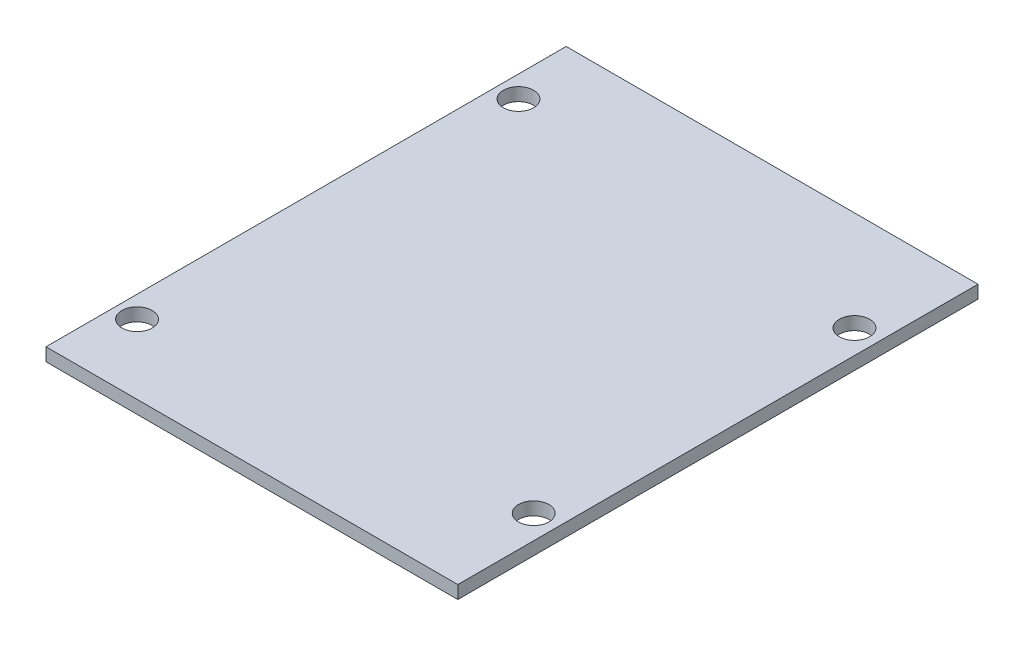
ISO-10303-21;
HEADER;
FILE_DESCRIPTION(('STEP AP214'),'2;1');
FILE_NAME('part.step','',(''),(''),'','','');
FILE_SCHEMA(('AUTOMOTIVE_DESIGN { 1 0 10303 214 1 1 1 1 }'));
ENDSEC;
DATA;
#1=APPLICATION_CONTEXT('core data for automotive mechanical design processes');
#2=APPLICATION_PROTOCOL_DEFINITION('international standard','automotive_design',2000,#1);
#3=PRODUCT_CONTEXT('',#1,'mechanical');
#4=PRODUCT('Part','Part','',(#3));
#5=PRODUCT_RELATED_PRODUCT_CATEGORY('part','',(#4));
#6=PRODUCT_DEFINITION_FORMATION('','',#4);
#7=PRODUCT_DEFINITION_CONTEXT('part definition',#1,'design');
#8=PRODUCT_DEFINITION('design','',#6,#7);
#9=PRODUCT_DEFINITION_SHAPE('','',#8);
#10=(LENGTH_UNIT() NAMED_UNIT(*) SI_UNIT(.MILLI.,.METRE.));
#11=(NAMED_UNIT(*) PLANE_ANGLE_UNIT() SI_UNIT($,.RADIAN.));
#12=(NAMED_UNIT(*) SI_UNIT($,.STERADIAN.) SOLID_ANGLE_UNIT());
#13=UNCERTAINTY_MEASURE_WITH_UNIT(LENGTH_MEASURE(1.E-05),#10,'distance_accuracy_value','');
#14=(GEOMETRIC_REPRESENTATION_CONTEXT(3) GLOBAL_UNCERTAINTY_ASSIGNED_CONTEXT((#13)) GLOBAL_UNIT_ASSIGNED_CONTEXT((#10,
#11,#12)) REPRESENTATION_CONTEXT('',''));
#15=CARTESIAN_POINT('',(0.,0.,0.));
#16=DIRECTION('',(0.,0.,1.));
#17=DIRECTION('',(1.,0.,0.));
#18=AXIS2_PLACEMENT_3D('',#15,#16,#17);
#19=CARTESIAN_POINT('',(0.,3.,0.));
#20=DIRECTION('',(1.,0.,0.));
#21=DIRECTION('',(0.,0.,-1.));
#22=AXIS2_PLACEMENT_3D('',#19,#20,#21);
#23=PLANE('',#22);
#24=DIRECTION('',(0.,0.,1.));
#25=VECTOR('',#24,1.);
#26=CARTESIAN_POINT('',(0.,0.,0.));
#27=LINE('',#26,#25);
#28=CARTESIAN_POINT('',(0.,0.,-120.));
#29=VERTEX_POINT('',#28);
#30=CARTESIAN_POINT('',(0.,0.,0.));
#31=VERTEX_POINT('',#30);
#32=EDGE_CURVE('E107',#29,#31,#27,.T.);
#33=ORIENTED_EDGE('',*,*,#32,.T.);
#34=DIRECTION('',(0.,-1.,0.));
#35=VECTOR('',#34,1.);
#36=CARTESIAN_POINT('',(0.,3.,0.));
#37=LINE('',#36,#35);
#38=CARTESIAN_POINT('',(0.,3.,0.));
#39=VERTEX_POINT('',#38);
#40=EDGE_CURVE('E11',#39,#31,#37,.T.);
#41=ORIENTED_EDGE('',*,*,#40,.F.);
#42=DIRECTION('',(0.,0.,1.));
#43=VECTOR('',#42,1.);
#44=CARTESIAN_POINT('',(0.,3.,0.));
#45=LINE('',#44,#43);
#46=CARTESIAN_POINT('',(0.,3.,-120.));
#47=VERTEX_POINT('',#46);
#48=EDGE_CURVE('E91',#47,#39,#45,.T.);
#49=ORIENTED_EDGE('',*,*,#48,.F.);
#50=DIRECTION('',(0.,-1.,0.));
#51=VECTOR('',#50,1.);
#52=CARTESIAN_POINT('',(0.,3.,-120.));
#53=LINE('',#52,#51);
#54=EDGE_CURVE('E103',#47,#29,#53,.T.);
#55=ORIENTED_EDGE('',*,*,#54,.T.);
#56=EDGE_LOOP('',(#33,#41,#49,#55));
#57=FACE_BOUND('',#56,.T.);
#58=ADVANCED_FACE('F39',(#57),#23,.F.);
#59=CARTESIAN_POINT('',(0.,3.,0.));
#60=DIRECTION('',(0.,0.,-1.));
#61=DIRECTION('',(-1.,0.,0.));
#62=AXIS2_PLACEMENT_3D('',#59,#60,#61);
#63=PLANE('',#62);
#64=DIRECTION('',(1.,0.,0.));
#65=VECTOR('',#64,1.);
#66=CARTESIAN_POINT('',(0.,0.,0.));
#67=LINE('',#66,#65);
#68=CARTESIAN_POINT('',(95.,0.,0.));
#69=VERTEX_POINT('',#68);
#70=EDGE_CURVE('E96',#31,#69,#67,.T.);
#71=ORIENTED_EDGE('',*,*,#70,.T.);
#72=DIRECTION('',(0.,-1.,0.));
#73=VECTOR('',#72,1.);
#74=CARTESIAN_POINT('',(95.,3.,0.));
#75=LINE('',#74,#73);
#76=CARTESIAN_POINT('',(95.,3.,0.));
#77=VERTEX_POINT('',#76);
#78=EDGE_CURVE('E48',#77,#69,#75,.T.);
#79=ORIENTED_EDGE('',*,*,#78,.F.);
#80=DIRECTION('',(1.,0.,0.));
#81=VECTOR('',#80,1.);
#82=CARTESIAN_POINT('',(0.,3.,0.));
#83=LINE('',#82,#81);
#84=EDGE_CURVE('E86',#39,#77,#83,.T.);
#85=ORIENTED_EDGE('',*,*,#84,.F.);
#86=ORIENTED_EDGE('',*,*,#40,.T.);
#87=EDGE_LOOP('',(#71,#79,#85,#86));
#88=FACE_BOUND('',#87,.T.);
#89=ADVANCED_FACE('F95',(#88),#63,.F.);
#90=CARTESIAN_POINT('',(95.,3.,0.));
#91=DIRECTION('',(-1.,0.,0.));
#92=DIRECTION('',(0.,0.,1.));
#93=AXIS2_PLACEMENT_3D('',#90,#91,#92);
#94=PLANE('',#93);
#95=DIRECTION('',(0.,0.,-1.));
#96=VECTOR('',#95,1.);
#97=CARTESIAN_POINT('',(95.,0.,0.));
#98=LINE('',#97,#96);
#99=CARTESIAN_POINT('',(95.,0.,-120.));
#100=VERTEX_POINT('',#99);
#101=EDGE_CURVE('E73',#69,#100,#98,.T.);
#102=ORIENTED_EDGE('',*,*,#101,.T.);
#103=DIRECTION('',(0.,-1.,0.));
#104=VECTOR('',#103,1.);
#105=CARTESIAN_POINT('',(95.,3.,-120.));
#106=LINE('',#105,#104);
#107=CARTESIAN_POINT('',(95.,3.,-120.));
#108=VERTEX_POINT('',#107);
#109=EDGE_CURVE('E98',#108,#100,#106,.T.);
#110=ORIENTED_EDGE('',*,*,#109,.F.);
#111=DIRECTION('',(0.,0.,-1.));
#112=VECTOR('',#111,1.);
#113=CARTESIAN_POINT('',(95.,3.,0.));
#114=LINE('',#113,#112);
#115=EDGE_CURVE('E89',#77,#108,#114,.T.);
#116=ORIENTED_EDGE('',*,*,#115,.F.);
#117=ORIENTED_EDGE('',*,*,#78,.T.);
#118=EDGE_LOOP('',(#102,#110,#116,#117));
#119=FACE_BOUND('',#118,.T.);
#120=ADVANCED_FACE('F99',(#119),#94,.F.);
#121=CARTESIAN_POINT('',(0.,3.,-120.));
#122=DIRECTION('',(0.,0.,1.));
#123=DIRECTION('',(1.,0.,0.));
#124=AXIS2_PLACEMENT_3D('',#121,#122,#123);
#125=PLANE('',#124);
#126=DIRECTION('',(-1.,0.,0.));
#127=VECTOR('',#126,1.);
#128=CARTESIAN_POINT('',(0.,0.,-120.));
#129=LINE('',#128,#127);
#130=EDGE_CURVE('E79',#100,#29,#129,.T.);
#131=ORIENTED_EDGE('',*,*,#130,.T.);
#132=ORIENTED_EDGE('',*,*,#54,.F.);
#133=DIRECTION('',(-1.,0.,0.));
#134=VECTOR('',#133,1.);
#135=CARTESIAN_POINT('',(0.,3.,-120.));
#136=LINE('',#135,#134);
#137=EDGE_CURVE('E56',#108,#47,#136,.T.);
#138=ORIENTED_EDGE('',*,*,#137,.F.);
#139=ORIENTED_EDGE('',*,*,#109,.T.);
#140=EDGE_LOOP('',(#131,#132,#138,#139));
#141=FACE_BOUND('',#140,.T.);
#142=ADVANCED_FACE('F121',(#141),#125,.F.);
#143=CARTESIAN_POINT('',(0.,3.,0.));
#144=DIRECTION('',(0.,-1.,0.));
#145=DIRECTION('',(0.,0.,-1.));
#146=AXIS2_PLACEMENT_3D('',#143,#144,#145);
#147=PLANE('',#146);
#148=CARTESIAN_POINT('',(5.00000000000001,3.,-104.));
#149=DIRECTION('',(0.,1.,0.));
#150=DIRECTION('',(0.,0.,-1.));
#151=AXIS2_PLACEMENT_3D('',#148,#149,#150);
#152=CIRCLE('',#151,3.5);
#153=CARTESIAN_POINT('',(5.00000000000001,3.,-107.5));
#154=VERTEX_POINT('',#153);
#155=EDGE_CURVE('E136',#154,#154,#152,.T.);
#156=ORIENTED_EDGE('',*,*,#155,.F.);
#157=EDGE_LOOP('',(#156));
#158=FACE_BOUND('',#157,.T.);
#159=CARTESIAN_POINT('',(5.00000000000001,3.,-16.));
#160=DIRECTION('',(0.,1.,0.));
#161=DIRECTION('',(0.,0.,1.));
#162=AXIS2_PLACEMENT_3D('',#159,#160,#161);
#163=CIRCLE('',#162,3.5);
#164=CARTESIAN_POINT('',(5.00000000000001,3.,-12.5));
#165=VERTEX_POINT('',#164);
#166=EDGE_CURVE('E144',#165,#165,#163,.T.);
#167=ORIENTED_EDGE('',*,*,#166,.F.);
#168=EDGE_LOOP('',(#167));
#169=FACE_BOUND('',#168,.T.);
#170=CARTESIAN_POINT('',(89.5,3.,-23.));
#171=DIRECTION('',(0.,1.,0.));
#172=DIRECTION('',(0.,0.,1.));
#173=AXIS2_PLACEMENT_3D('',#170,#171,#172);
#174=CIRCLE('',#173,3.50000000000001);
#175=CARTESIAN_POINT('',(89.5,3.,-19.5));
#176=VERTEX_POINT('',#175);
#177=EDGE_CURVE('E152',#176,#176,#174,.T.);
#178=ORIENTED_EDGE('',*,*,#177,.F.);
#179=EDGE_LOOP('',(#178));
#180=FACE_BOUND('',#179,.T.);
#181=CARTESIAN_POINT('',(89.5,3.,-97.));
#182=DIRECTION('',(0.,1.,0.));
#183=DIRECTION('',(0.,0.,-1.));
#184=AXIS2_PLACEMENT_3D('',#181,#182,#183);
#185=CIRCLE('',#184,3.50000000000001);
#186=CARTESIAN_POINT('',(89.5,3.,-100.5));
#187=VERTEX_POINT('',#186);
#188=EDGE_CURVE('E128',#187,#187,#185,.T.);
#189=ORIENTED_EDGE('',*,*,#188,.F.);
#190=EDGE_LOOP('',(#189));
#191=FACE_BOUND('',#190,.T.);
#192=ORIENTED_EDGE('',*,*,#48,.T.);
#193=ORIENTED_EDGE('',*,*,#84,.T.);
#194=ORIENTED_EDGE('',*,*,#115,.T.);
#195=ORIENTED_EDGE('',*,*,#137,.T.);
#196=EDGE_LOOP('',(#192,#193,#194,#195));
#197=FACE_BOUND('',#196,.T.);
#198=ADVANCED_FACE('F87',(#158,#169,#180,#191,#197),#147,.F.);
#199=CARTESIAN_POINT('',(0.,0.,0.));
#200=DIRECTION('',(0.,-1.,0.));
#201=DIRECTION('',(0.,0.,-1.));
#202=AXIS2_PLACEMENT_3D('',#199,#200,#201);
#203=PLANE('',#202);
#204=CARTESIAN_POINT('',(5.00000000000001,0.,-104.));
#205=DIRECTION('',(0.,1.,0.));
#206=DIRECTION('',(0.,0.,-1.));
#207=AXIS2_PLACEMENT_3D('',#204,#205,#206);
#208=CIRCLE('',#207,3.5);
#209=CARTESIAN_POINT('',(5.00000000000001,0.,-107.5));
#210=VERTEX_POINT('',#209);
#211=EDGE_CURVE('E140',#210,#210,#208,.T.);
#212=ORIENTED_EDGE('',*,*,#211,.T.);
#213=EDGE_LOOP('',(#212));
#214=FACE_BOUND('',#213,.T.);
#215=CARTESIAN_POINT('',(5.00000000000001,0.,-16.));
#216=DIRECTION('',(0.,1.,0.));
#217=DIRECTION('',(0.,0.,1.));
#218=AXIS2_PLACEMENT_3D('',#215,#216,#217);
#219=CIRCLE('',#218,3.5);
#220=CARTESIAN_POINT('',(5.00000000000001,0.,-12.5));
#221=VERTEX_POINT('',#220);
#222=EDGE_CURVE('E148',#221,#221,#219,.T.);
#223=ORIENTED_EDGE('',*,*,#222,.T.);
#224=EDGE_LOOP('',(#223));
#225=FACE_BOUND('',#224,.T.);
#226=CARTESIAN_POINT('',(89.5,0.,-23.));
#227=DIRECTION('',(0.,1.,0.));
#228=DIRECTION('',(0.,0.,1.));
#229=AXIS2_PLACEMENT_3D('',#226,#227,#228);
#230=CIRCLE('',#229,3.50000000000001);
#231=CARTESIAN_POINT('',(89.5,0.,-19.5));
#232=VERTEX_POINT('',#231);
#233=EDGE_CURVE('E132',#232,#232,#230,.T.);
#234=ORIENTED_EDGE('',*,*,#233,.T.);
#235=EDGE_LOOP('',(#234));
#236=FACE_BOUND('',#235,.T.);
#237=CARTESIAN_POINT('',(89.5,0.,-97.));
#238=DIRECTION('',(0.,1.,0.));
#239=DIRECTION('',(0.,0.,-1.));
#240=AXIS2_PLACEMENT_3D('',#237,#238,#239);
#241=CIRCLE('',#240,3.50000000000001);
#242=CARTESIAN_POINT('',(89.5,0.,-100.5));
#243=VERTEX_POINT('',#242);
#244=EDGE_CURVE('E111',#243,#243,#241,.T.);
#245=ORIENTED_EDGE('',*,*,#244,.T.);
#246=EDGE_LOOP('',(#245));
#247=FACE_BOUND('',#246,.T.);
#248=ORIENTED_EDGE('',*,*,#32,.F.);
#249=ORIENTED_EDGE('',*,*,#130,.F.);
#250=ORIENTED_EDGE('',*,*,#101,.F.);
#251=ORIENTED_EDGE('',*,*,#70,.F.);
#252=EDGE_LOOP('',(#248,#249,#250,#251));
#253=FACE_BOUND('',#252,.T.);
#254=ADVANCED_FACE('F124',(#214,#225,#236,#247,#253),#203,.T.);
#255=CARTESIAN_POINT('',(89.5,0.,-97.));
#256=DIRECTION('',(0.,1.,0.));
#257=DIRECTION('',(0.,0.,1.));
#258=AXIS2_PLACEMENT_3D('',#255,#256,#257);
#259=CYLINDRICAL_SURFACE('',#258,3.50000000000001);
#260=ORIENTED_EDGE('',*,*,#244,.F.);
#261=EDGE_LOOP('',(#260));
#262=FACE_BOUND('',#261,.T.);
#263=ORIENTED_EDGE('',*,*,#188,.T.);
#264=EDGE_LOOP('',(#263));
#265=FACE_BOUND('',#264,.T.);
#266=ADVANCED_FACE('F166',(#262,#265),#259,.F.);
#267=CARTESIAN_POINT('',(89.5,0.,-23.));
#268=DIRECTION('',(0.,1.,0.));
#269=DIRECTION('',(0.,0.,1.));
#270=AXIS2_PLACEMENT_3D('',#267,#268,#269);
#271=CYLINDRICAL_SURFACE('',#270,3.50000000000001);
#272=ORIENTED_EDGE('',*,*,#233,.F.);
#273=EDGE_LOOP('',(#272));
#274=FACE_BOUND('',#273,.T.);
#275=ORIENTED_EDGE('',*,*,#177,.T.);
#276=EDGE_LOOP('',(#275));
#277=FACE_BOUND('',#276,.T.);
#278=ADVANCED_FACE('F162',(#274,#277),#271,.F.);
#279=CARTESIAN_POINT('',(5.00000000000001,0.,-16.));
#280=DIRECTION('',(0.,1.,0.));
#281=DIRECTION('',(0.,0.,1.));
#282=AXIS2_PLACEMENT_3D('',#279,#280,#281);
#283=CYLINDRICAL_SURFACE('',#282,3.5);
#284=ORIENTED_EDGE('',*,*,#222,.F.);
#285=EDGE_LOOP('',(#284));
#286=FACE_BOUND('',#285,.T.);
#287=ORIENTED_EDGE('',*,*,#166,.T.);
#288=EDGE_LOOP('',(#287));
#289=FACE_BOUND('',#288,.T.);
#290=ADVANCED_FACE('F165',(#286,#289),#283,.F.);
#291=CARTESIAN_POINT('',(5.00000000000001,0.,-104.));
#292=DIRECTION('',(0.,1.,0.));
#293=DIRECTION('',(0.,0.,1.));
#294=AXIS2_PLACEMENT_3D('',#291,#292,#293);
#295=CYLINDRICAL_SURFACE('',#294,3.5);
#296=ORIENTED_EDGE('',*,*,#211,.F.);
#297=EDGE_LOOP('',(#296));
#298=FACE_BOUND('',#297,.T.);
#299=ORIENTED_EDGE('',*,*,#155,.T.);
#300=EDGE_LOOP('',(#299));
#301=FACE_BOUND('',#300,.T.);
#302=ADVANCED_FACE('F227',(#298,#301),#295,.F.);
#303=CLOSED_SHELL('',(#58,#89,#120,#142,#198,#254,#266,#278,#290,#302));
#304=MANIFOLD_SOLID_BREP('B2',#303);
#305=ADVANCED_BREP_SHAPE_REPRESENTATION('',(#18,#304),#14);
#306=SHAPE_DEFINITION_REPRESENTATION(#9,#305);
ENDSEC;
END-ISO-10303-21;
